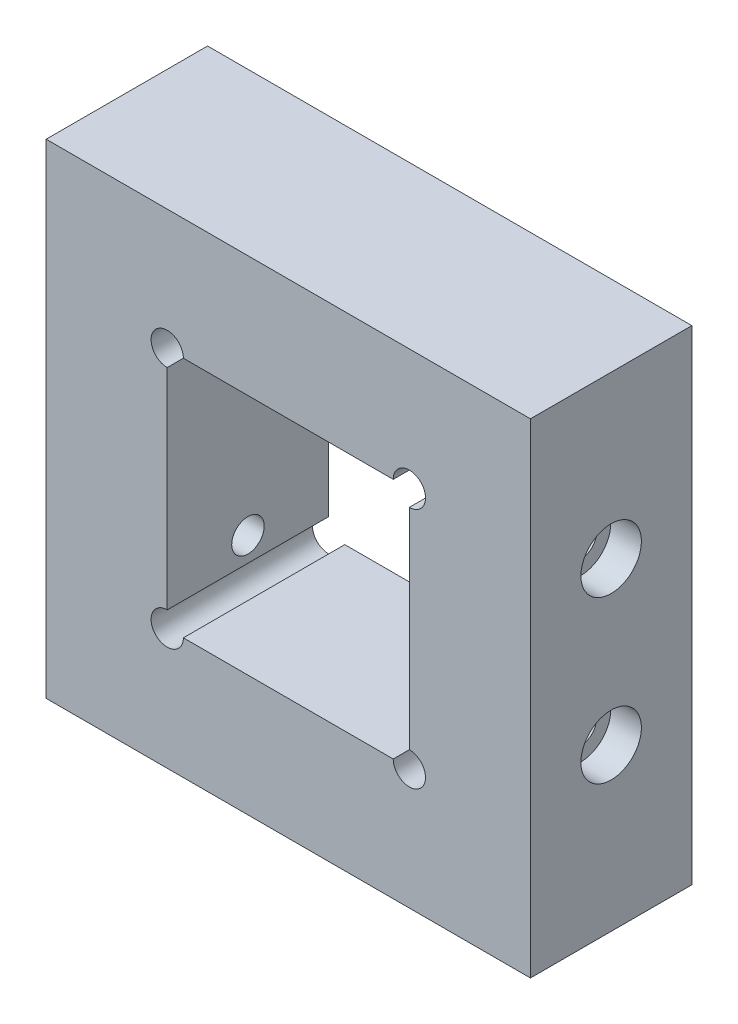
ISO-10303-21;
HEADER;
FILE_DESCRIPTION(('STEP AP214'),'2;1');
FILE_NAME('part.step','',(''),(''),'','','');
FILE_SCHEMA(('AUTOMOTIVE_DESIGN { 1 0 10303 214 1 1 1 1 }'));
ENDSEC;
DATA;
#1=APPLICATION_CONTEXT('core data for automotive mechanical design processes');
#2=APPLICATION_PROTOCOL_DEFINITION('international standard','automotive_design',2000,#1);
#3=PRODUCT_CONTEXT('',#1,'mechanical');
#4=PRODUCT('Part','Part','',(#3));
#5=PRODUCT_RELATED_PRODUCT_CATEGORY('part','',(#4));
#6=PRODUCT_DEFINITION_FORMATION('','',#4);
#7=PRODUCT_DEFINITION_CONTEXT('part definition',#1,'design');
#8=PRODUCT_DEFINITION('design','',#6,#7);
#9=PRODUCT_DEFINITION_SHAPE('','',#8);
#10=(LENGTH_UNIT() NAMED_UNIT(*) SI_UNIT(.MILLI.,.METRE.));
#11=(NAMED_UNIT(*) PLANE_ANGLE_UNIT() SI_UNIT($,.RADIAN.));
#12=(NAMED_UNIT(*) SI_UNIT($,.STERADIAN.) SOLID_ANGLE_UNIT());
#13=UNCERTAINTY_MEASURE_WITH_UNIT(LENGTH_MEASURE(1.E-05),#10,'distance_accuracy_value','');
#14=(GEOMETRIC_REPRESENTATION_CONTEXT(3) GLOBAL_UNCERTAINTY_ASSIGNED_CONTEXT((#13)) GLOBAL_UNIT_ASSIGNED_CONTEXT((#10,
#11,#12)) REPRESENTATION_CONTEXT('',''));
#15=CARTESIAN_POINT('',(0.,0.,0.));
#16=DIRECTION('',(0.,0.,1.));
#17=DIRECTION('',(1.,0.,0.));
#18=AXIS2_PLACEMENT_3D('',#15,#16,#17);
#19=CARTESIAN_POINT('',(0.,0.,12.7));
#20=DIRECTION('',(0.,0.,1.));
#21=DIRECTION('',(1.,0.,0.));
#22=AXIS2_PLACEMENT_3D('',#19,#20,#21);
#23=PLANE('',#22);
#24=DIRECTION('',(0.,-1.,0.));
#25=VECTOR('',#24,1.);
#26=CARTESIAN_POINT('',(-38.1,38.1,12.7));
#27=LINE('',#26,#25);
#28=CARTESIAN_POINT('',(-38.1,38.1,12.7));
#29=VERTEX_POINT('',#28);
#30=CARTESIAN_POINT('',(-38.1,-38.1,12.7));
#31=VERTEX_POINT('',#30);
#32=EDGE_CURVE('E159',#29,#31,#27,.T.);
#33=ORIENTED_EDGE('',*,*,#32,.T.);
#34=DIRECTION('',(1.,0.,0.));
#35=VECTOR('',#34,1.);
#36=CARTESIAN_POINT('',(-38.1,-38.1,12.7));
#37=LINE('',#36,#35);
#38=CARTESIAN_POINT('',(38.1,-38.1,12.7));
#39=VERTEX_POINT('',#38);
#40=EDGE_CURVE('E162',#31,#39,#37,.T.);
#41=ORIENTED_EDGE('',*,*,#40,.T.);
#42=DIRECTION('',(0.,1.,0.));
#43=VECTOR('',#42,1.);
#44=CARTESIAN_POINT('',(38.1,38.1,12.7));
#45=LINE('',#44,#43);
#46=CARTESIAN_POINT('',(38.1,38.1,12.7));
#47=VERTEX_POINT('',#46);
#48=EDGE_CURVE('E165',#39,#47,#45,.T.);
#49=ORIENTED_EDGE('',*,*,#48,.T.);
#50=DIRECTION('',(-1.,0.,0.));
#51=VECTOR('',#50,1.);
#52=CARTESIAN_POINT('',(-38.1,38.1,12.7));
#53=LINE('',#52,#51);
#54=EDGE_CURVE('E167',#47,#29,#53,.T.);
#55=ORIENTED_EDGE('',*,*,#54,.T.);
#56=EDGE_LOOP('',(#33,#41,#49,#55));
#57=FACE_BOUND('',#56,.T.);
#58=DIRECTION('',(1.,0.,0.));
#59=VECTOR('',#58,1.);
#60=CARTESIAN_POINT('',(-19.05,-19.05,12.7));
#61=LINE('',#60,#59);
#62=CARTESIAN_POINT('',(-16.51,-19.05,12.7));
#63=VERTEX_POINT('',#62);
#64=CARTESIAN_POINT('',(16.51,-19.05,12.7));
#65=VERTEX_POINT('',#64);
#66=EDGE_CURVE('E138',#63,#65,#61,.T.);
#67=ORIENTED_EDGE('',*,*,#66,.F.);
#68=CARTESIAN_POINT('',(-19.05,-19.05,12.7));
#69=DIRECTION('',(0.,0.,-1.));
#70=DIRECTION('',(-1.,0.,0.));
#71=AXIS2_PLACEMENT_3D('',#68,#69,#70);
#72=CIRCLE('',#71,2.54);
#73=CARTESIAN_POINT('',(-19.05,-16.51,12.7));
#74=VERTEX_POINT('',#73);
#75=EDGE_CURVE('E50',#63,#74,#72,.T.);
#76=ORIENTED_EDGE('',*,*,#75,.T.);
#77=DIRECTION('',(0.,-1.,0.));
#78=VECTOR('',#77,1.);
#79=CARTESIAN_POINT('',(-19.05,19.05,12.7));
#80=LINE('',#79,#78);
#81=CARTESIAN_POINT('',(-19.05,16.51,12.7));
#82=VERTEX_POINT('',#81);
#83=EDGE_CURVE('E136',#82,#74,#80,.T.);
#84=ORIENTED_EDGE('',*,*,#83,.F.);
#85=CARTESIAN_POINT('',(-19.05,19.05,12.7));
#86=DIRECTION('',(0.,0.,-1.));
#87=DIRECTION('',(-1.,0.,0.));
#88=AXIS2_PLACEMENT_3D('',#85,#86,#87);
#89=CIRCLE('',#88,2.54);
#90=CARTESIAN_POINT('',(-16.51,19.05,12.7));
#91=VERTEX_POINT('',#90);
#92=EDGE_CURVE('E258',#82,#91,#89,.T.);
#93=ORIENTED_EDGE('',*,*,#92,.T.);
#94=DIRECTION('',(-1.,0.,0.));
#95=VECTOR('',#94,1.);
#96=CARTESIAN_POINT('',(-19.05,19.05,12.7));
#97=LINE('',#96,#95);
#98=CARTESIAN_POINT('',(16.51,19.05,12.7));
#99=VERTEX_POINT('',#98);
#100=EDGE_CURVE('E155',#99,#91,#97,.T.);
#101=ORIENTED_EDGE('',*,*,#100,.F.);
#102=CARTESIAN_POINT('',(19.05,19.05,12.7));
#103=DIRECTION('',(0.,0.,1.));
#104=DIRECTION('',(1.,0.,0.));
#105=AXIS2_PLACEMENT_3D('',#102,#103,#104);
#106=CIRCLE('',#105,2.54);
#107=CARTESIAN_POINT('',(19.05,16.51,12.7));
#108=VERTEX_POINT('',#107);
#109=EDGE_CURVE('E299',#108,#99,#106,.T.);
#110=ORIENTED_EDGE('',*,*,#109,.F.);
#111=DIRECTION('',(0.,1.,0.));
#112=VECTOR('',#111,1.);
#113=CARTESIAN_POINT('',(19.05,19.05,12.7));
#114=LINE('',#113,#112);
#115=CARTESIAN_POINT('',(19.05,-16.51,12.7));
#116=VERTEX_POINT('',#115);
#117=EDGE_CURVE('E145',#116,#108,#114,.T.);
#118=ORIENTED_EDGE('',*,*,#117,.F.);
#119=CARTESIAN_POINT('',(19.05,-19.05,12.7));
#120=DIRECTION('',(0.,0.,1.));
#121=DIRECTION('',(1.,0.,0.));
#122=AXIS2_PLACEMENT_3D('',#119,#120,#121);
#123=CIRCLE('',#122,2.54);
#124=EDGE_CURVE('E289',#65,#116,#123,.T.);
#125=ORIENTED_EDGE('',*,*,#124,.F.);
#126=EDGE_LOOP('',(#67,#76,#84,#93,#101,#110,#118,#125));
#127=FACE_BOUND('',#126,.T.);
#128=ADVANCED_FACE('F35',(#57,#127),#23,.T.);
#129=CARTESIAN_POINT('',(0.,0.,-12.7));
#130=DIRECTION('',(0.,0.,1.));
#131=DIRECTION('',(1.,0.,0.));
#132=AXIS2_PLACEMENT_3D('',#129,#130,#131);
#133=PLANE('',#132);
#134=DIRECTION('',(0.,-1.,0.));
#135=VECTOR('',#134,1.);
#136=CARTESIAN_POINT('',(-38.1,38.1,-12.7));
#137=LINE('',#136,#135);
#138=CARTESIAN_POINT('',(-38.1,38.1,-12.7));
#139=VERTEX_POINT('',#138);
#140=CARTESIAN_POINT('',(-38.1,-38.1,-12.7));
#141=VERTEX_POINT('',#140);
#142=EDGE_CURVE('E170',#139,#141,#137,.T.);
#143=ORIENTED_EDGE('',*,*,#142,.F.);
#144=DIRECTION('',(-1.,0.,0.));
#145=VECTOR('',#144,1.);
#146=CARTESIAN_POINT('',(-38.1,38.1,-12.7));
#147=LINE('',#146,#145);
#148=CARTESIAN_POINT('',(38.1,38.1,-12.7));
#149=VERTEX_POINT('',#148);
#150=EDGE_CURVE('E163',#149,#139,#147,.T.);
#151=ORIENTED_EDGE('',*,*,#150,.F.);
#152=DIRECTION('',(0.,1.,0.));
#153=VECTOR('',#152,1.);
#154=CARTESIAN_POINT('',(38.1,38.1,-12.7));
#155=LINE('',#154,#153);
#156=CARTESIAN_POINT('',(38.1,-38.1,-12.7));
#157=VERTEX_POINT('',#156);
#158=EDGE_CURVE('E175',#157,#149,#155,.T.);
#159=ORIENTED_EDGE('',*,*,#158,.F.);
#160=DIRECTION('',(1.,0.,0.));
#161=VECTOR('',#160,1.);
#162=CARTESIAN_POINT('',(-38.1,-38.1,-12.7));
#163=LINE('',#162,#161);
#164=EDGE_CURVE('E173',#141,#157,#163,.T.);
#165=ORIENTED_EDGE('',*,*,#164,.F.);
#166=EDGE_LOOP('',(#143,#151,#159,#165));
#167=FACE_BOUND('',#166,.T.);
#168=CARTESIAN_POINT('',(-19.05,-19.05,-12.7));
#169=DIRECTION('',(0.,0.,1.));
#170=DIRECTION('',(1.,0.,0.));
#171=AXIS2_PLACEMENT_3D('',#168,#169,#170);
#172=CIRCLE('',#171,2.54);
#173=CARTESIAN_POINT('',(-19.05,-16.51,-12.7));
#174=VERTEX_POINT('',#173);
#175=CARTESIAN_POINT('',(-16.51,-19.05,-12.7));
#176=VERTEX_POINT('',#175);
#177=EDGE_CURVE('E125',#174,#176,#172,.T.);
#178=ORIENTED_EDGE('',*,*,#177,.T.);
#179=DIRECTION('',(1.,0.,0.));
#180=VECTOR('',#179,1.);
#181=CARTESIAN_POINT('',(-19.05,-19.05,-12.7));
#182=LINE('',#181,#180);
#183=CARTESIAN_POINT('',(16.51,-19.05,-12.7));
#184=VERTEX_POINT('',#183);
#185=EDGE_CURVE('E251',#176,#184,#182,.T.);
#186=ORIENTED_EDGE('',*,*,#185,.T.);
#187=CARTESIAN_POINT('',(19.05,-19.05,-12.7));
#188=DIRECTION('',(0.,0.,1.));
#189=DIRECTION('',(1.,0.,0.));
#190=AXIS2_PLACEMENT_3D('',#187,#188,#189);
#191=CIRCLE('',#190,2.54);
#192=CARTESIAN_POINT('',(19.05,-16.51,-12.7));
#193=VERTEX_POINT('',#192);
#194=EDGE_CURVE('E291',#193,#184,#191,.F.);
#195=ORIENTED_EDGE('',*,*,#194,.F.);
#196=DIRECTION('',(0.,1.,0.));
#197=VECTOR('',#196,1.);
#198=CARTESIAN_POINT('',(19.05,19.05,-12.7));
#199=LINE('',#198,#197);
#200=CARTESIAN_POINT('',(19.05,16.51,-12.7));
#201=VERTEX_POINT('',#200);
#202=EDGE_CURVE('E324',#193,#201,#199,.T.);
#203=ORIENTED_EDGE('',*,*,#202,.T.);
#204=CARTESIAN_POINT('',(19.05,19.05,-12.7));
#205=DIRECTION('',(0.,0.,1.));
#206=DIRECTION('',(1.,0.,0.));
#207=AXIS2_PLACEMENT_3D('',#204,#205,#206);
#208=CIRCLE('',#207,2.54);
#209=CARTESIAN_POINT('',(16.51,19.05,-12.7));
#210=VERTEX_POINT('',#209);
#211=EDGE_CURVE('E301',#210,#201,#208,.F.);
#212=ORIENTED_EDGE('',*,*,#211,.F.);
#213=DIRECTION('',(-1.,0.,0.));
#214=VECTOR('',#213,1.);
#215=CARTESIAN_POINT('',(-19.05,19.05,-12.7));
#216=LINE('',#215,#214);
#217=CARTESIAN_POINT('',(-16.51,19.05,-12.7));
#218=VERTEX_POINT('',#217);
#219=EDGE_CURVE('E151',#210,#218,#216,.T.);
#220=ORIENTED_EDGE('',*,*,#219,.T.);
#221=CARTESIAN_POINT('',(-19.05,19.05,-12.7));
#222=DIRECTION('',(0.,0.,1.));
#223=DIRECTION('',(1.,0.,0.));
#224=AXIS2_PLACEMENT_3D('',#221,#222,#223);
#225=CIRCLE('',#224,2.54);
#226=CARTESIAN_POINT('',(-19.05,16.51,-12.7));
#227=VERTEX_POINT('',#226);
#228=EDGE_CURVE('E58',#218,#227,#225,.T.);
#229=ORIENTED_EDGE('',*,*,#228,.T.);
#230=DIRECTION('',(0.,-1.,0.));
#231=VECTOR('',#230,1.);
#232=CARTESIAN_POINT('',(-19.05,19.05,-12.7));
#233=LINE('',#232,#231);
#234=EDGE_CURVE('E158',#227,#174,#233,.T.);
#235=ORIENTED_EDGE('',*,*,#234,.T.);
#236=EDGE_LOOP('',(#178,#186,#195,#203,#212,#220,#229,#235));
#237=FACE_BOUND('',#236,.T.);
#238=ADVANCED_FACE('F193',(#167,#237),#133,.F.);
#239=CARTESIAN_POINT('',(-19.05,19.05,-12.7));
#240=DIRECTION('',(-1.,0.,0.));
#241=DIRECTION('',(0.,-1.,0.));
#242=AXIS2_PLACEMENT_3D('',#239,#240,#241);
#243=PLANE('',#242);
#244=CARTESIAN_POINT('',(-19.05,12.7,0.));
#245=DIRECTION('',(-1.,0.,0.));
#246=DIRECTION('',(0.,-1.,0.));
#247=AXIS2_PLACEMENT_3D('',#244,#245,#246);
#248=CIRCLE('',#247,2.5527);
#249=CARTESIAN_POINT('',(-19.05,10.1473,0.));
#250=VERTEX_POINT('',#249);
#251=EDGE_CURVE('E270',#250,#250,#248,.T.);
#252=ORIENTED_EDGE('',*,*,#251,.T.);
#253=EDGE_LOOP('',(#252));
#254=FACE_BOUND('',#253,.T.);
#255=CARTESIAN_POINT('',(-19.05,-12.7,0.));
#256=DIRECTION('',(-1.,0.,0.));
#257=DIRECTION('',(0.,-1.,0.));
#258=AXIS2_PLACEMENT_3D('',#255,#256,#257);
#259=CIRCLE('',#258,2.5527);
#260=CARTESIAN_POINT('',(-19.05,-15.2527,0.));
#261=VERTEX_POINT('',#260);
#262=EDGE_CURVE('E282',#261,#261,#259,.T.);
#263=ORIENTED_EDGE('',*,*,#262,.T.);
#264=EDGE_LOOP('',(#263));
#265=FACE_BOUND('',#264,.T.);
#266=DIRECTION('',(0.,0.,1.));
#267=VECTOR('',#266,1.);
#268=CARTESIAN_POINT('',(-19.05,-16.51,-12.701));
#269=LINE('',#268,#267);
#270=EDGE_CURVE('E122',#74,#174,#269,.F.);
#271=ORIENTED_EDGE('',*,*,#270,.T.);
#272=ORIENTED_EDGE('',*,*,#234,.F.);
#273=DIRECTION('',(0.,0.,1.));
#274=VECTOR('',#273,1.);
#275=CARTESIAN_POINT('',(-19.05,16.51,-12.701));
#276=LINE('',#275,#274);
#277=EDGE_CURVE('E142',#227,#82,#276,.T.);
#278=ORIENTED_EDGE('',*,*,#277,.T.);
#279=ORIENTED_EDGE('',*,*,#83,.T.);
#280=EDGE_LOOP('',(#271,#272,#278,#279));
#281=FACE_BOUND('',#280,.T.);
#282=ADVANCED_FACE('F141',(#254,#265,#281),#243,.F.);
#283=CARTESIAN_POINT('',(-19.05,-19.05,-12.7));
#284=DIRECTION('',(0.,-1.,0.));
#285=DIRECTION('',(0.,0.,-1.));
#286=AXIS2_PLACEMENT_3D('',#283,#284,#285);
#287=PLANE('',#286);
#288=DIRECTION('',(0.,0.,1.));
#289=VECTOR('',#288,1.);
#290=CARTESIAN_POINT('',(-16.51,-19.05,-12.701));
#291=LINE('',#290,#289);
#292=EDGE_CURVE('E130',#176,#63,#291,.T.);
#293=ORIENTED_EDGE('',*,*,#292,.T.);
#294=ORIENTED_EDGE('',*,*,#66,.T.);
#295=DIRECTION('',(0.,0.,1.));
#296=VECTOR('',#295,1.);
#297=CARTESIAN_POINT('',(16.51,-19.05,-12.701));
#298=LINE('',#297,#296);
#299=EDGE_CURVE('E285',#184,#65,#298,.T.);
#300=ORIENTED_EDGE('',*,*,#299,.F.);
#301=ORIENTED_EDGE('',*,*,#185,.F.);
#302=EDGE_LOOP('',(#293,#294,#300,#301));
#303=FACE_BOUND('',#302,.T.);
#304=ADVANCED_FACE('F239',(#303),#287,.F.);
#305=CARTESIAN_POINT('',(-19.05,19.05,-12.7));
#306=DIRECTION('',(0.,1.,0.));
#307=DIRECTION('',(0.,0.,1.));
#308=AXIS2_PLACEMENT_3D('',#305,#306,#307);
#309=PLANE('',#308);
#310=DIRECTION('',(0.,0.,1.));
#311=VECTOR('',#310,1.);
#312=CARTESIAN_POINT('',(-16.51,19.05,-12.701));
#313=LINE('',#312,#311);
#314=EDGE_CURVE('E255',#91,#218,#313,.F.);
#315=ORIENTED_EDGE('',*,*,#314,.T.);
#316=ORIENTED_EDGE('',*,*,#219,.F.);
#317=DIRECTION('',(0.,0.,1.));
#318=VECTOR('',#317,1.);
#319=CARTESIAN_POINT('',(16.51,19.05,-12.701));
#320=LINE('',#319,#318);
#321=EDGE_CURVE('E297',#99,#210,#320,.F.);
#322=ORIENTED_EDGE('',*,*,#321,.F.);
#323=ORIENTED_EDGE('',*,*,#100,.T.);
#324=EDGE_LOOP('',(#315,#316,#322,#323));
#325=FACE_BOUND('',#324,.T.);
#326=ADVANCED_FACE('F211',(#325),#309,.F.);
#327=CARTESIAN_POINT('',(-38.1,38.1,12.7));
#328=DIRECTION('',(1.,0.,0.));
#329=DIRECTION('',(0.,1.,0.));
#330=AXIS2_PLACEMENT_3D('',#327,#328,#329);
#331=PLANE('',#330);
#332=CARTESIAN_POINT('',(-38.1,12.7,0.));
#333=DIRECTION('',(-1.,0.,0.));
#334=DIRECTION('',(0.,0.,1.));
#335=AXIS2_PLACEMENT_3D('',#332,#333,#334);
#336=CIRCLE('',#335,4.7625);
#337=CARTESIAN_POINT('',(-38.1,12.7,4.7625));
#338=VERTEX_POINT('',#337);
#339=EDGE_CURVE('E261',#338,#338,#336,.T.);
#340=ORIENTED_EDGE('',*,*,#339,.F.);
#341=EDGE_LOOP('',(#340));
#342=FACE_BOUND('',#341,.T.);
#343=CARTESIAN_POINT('',(-38.1,-12.7,0.));
#344=DIRECTION('',(-1.,0.,0.));
#345=DIRECTION('',(0.,0.,1.));
#346=AXIS2_PLACEMENT_3D('',#343,#344,#345);
#347=CIRCLE('',#346,4.7625);
#348=CARTESIAN_POINT('',(-38.1,-12.7,4.7625));
#349=VERTEX_POINT('',#348);
#350=EDGE_CURVE('E273',#349,#349,#347,.T.);
#351=ORIENTED_EDGE('',*,*,#350,.F.);
#352=EDGE_LOOP('',(#351));
#353=FACE_BOUND('',#352,.T.);
#354=ORIENTED_EDGE('',*,*,#142,.T.);
#355=DIRECTION('',(0.,0.,-1.));
#356=VECTOR('',#355,1.);
#357=CARTESIAN_POINT('',(-38.1,-38.1,12.7));
#358=LINE('',#357,#356);
#359=EDGE_CURVE('E11',#31,#141,#358,.T.);
#360=ORIENTED_EDGE('',*,*,#359,.F.);
#361=ORIENTED_EDGE('',*,*,#32,.F.);
#362=DIRECTION('',(0.,0.,-1.));
#363=VECTOR('',#362,1.);
#364=CARTESIAN_POINT('',(-38.1,38.1,12.7));
#365=LINE('',#364,#363);
#366=EDGE_CURVE('E169',#29,#139,#365,.T.);
#367=ORIENTED_EDGE('',*,*,#366,.T.);
#368=EDGE_LOOP('',(#354,#360,#361,#367));
#369=FACE_BOUND('',#368,.T.);
#370=ADVANCED_FACE('F37',(#342,#353,#369),#331,.F.);
#371=CARTESIAN_POINT('',(-38.1,-38.1,12.7));
#372=DIRECTION('',(0.,1.,0.));
#373=DIRECTION('',(0.,0.,1.));
#374=AXIS2_PLACEMENT_3D('',#371,#372,#373);
#375=PLANE('',#374);
#376=ORIENTED_EDGE('',*,*,#164,.T.);
#377=DIRECTION('',(0.,0.,-1.));
#378=VECTOR('',#377,1.);
#379=CARTESIAN_POINT('',(38.1,-38.1,12.7));
#380=LINE('',#379,#378);
#381=EDGE_CURVE('E43',#39,#157,#380,.T.);
#382=ORIENTED_EDGE('',*,*,#381,.F.);
#383=ORIENTED_EDGE('',*,*,#40,.F.);
#384=ORIENTED_EDGE('',*,*,#359,.T.);
#385=EDGE_LOOP('',(#376,#382,#383,#384));
#386=FACE_BOUND('',#385,.T.);
#387=ADVANCED_FACE('F203',(#386),#375,.F.);
#388=CARTESIAN_POINT('',(38.1,38.1,12.7));
#389=DIRECTION('',(-1.,0.,0.));
#390=DIRECTION('',(0.,-1.,0.));
#391=AXIS2_PLACEMENT_3D('',#388,#389,#390);
#392=PLANE('',#391);
#393=CARTESIAN_POINT('',(38.1,12.7,0.));
#394=DIRECTION('',(1.,0.,0.));
#395=DIRECTION('',(0.,0.,-1.));
#396=AXIS2_PLACEMENT_3D('',#393,#394,#395);
#397=CIRCLE('',#396,4.7625);
#398=CARTESIAN_POINT('',(38.1,12.7,-4.7625));
#399=VERTEX_POINT('',#398);
#400=EDGE_CURVE('E304',#399,#399,#397,.T.);
#401=ORIENTED_EDGE('',*,*,#400,.F.);
#402=EDGE_LOOP('',(#401));
#403=FACE_BOUND('',#402,.T.);
#404=CARTESIAN_POINT('',(38.1,-12.7,0.));
#405=DIRECTION('',(1.,0.,0.));
#406=DIRECTION('',(0.,0.,-1.));
#407=AXIS2_PLACEMENT_3D('',#404,#405,#406);
#408=CIRCLE('',#407,4.7625);
#409=CARTESIAN_POINT('',(38.1,-12.7,-4.7625));
#410=VERTEX_POINT('',#409);
#411=EDGE_CURVE('E315',#410,#410,#408,.T.);
#412=ORIENTED_EDGE('',*,*,#411,.F.);
#413=EDGE_LOOP('',(#412));
#414=FACE_BOUND('',#413,.T.);
#415=ORIENTED_EDGE('',*,*,#158,.T.);
#416=DIRECTION('',(0.,0.,-1.));
#417=VECTOR('',#416,1.);
#418=CARTESIAN_POINT('',(38.1,38.1,12.7));
#419=LINE('',#418,#417);
#420=EDGE_CURVE('E180',#47,#149,#419,.T.);
#421=ORIENTED_EDGE('',*,*,#420,.F.);
#422=ORIENTED_EDGE('',*,*,#48,.F.);
#423=ORIENTED_EDGE('',*,*,#381,.T.);
#424=EDGE_LOOP('',(#415,#421,#422,#423));
#425=FACE_BOUND('',#424,.T.);
#426=ADVANCED_FACE('F187',(#403,#414,#425),#392,.F.);
#427=CARTESIAN_POINT('',(-38.1,38.1,12.7));
#428=DIRECTION('',(0.,-1.,0.));
#429=DIRECTION('',(0.,0.,-1.));
#430=AXIS2_PLACEMENT_3D('',#427,#428,#429);
#431=PLANE('',#430);
#432=ORIENTED_EDGE('',*,*,#150,.T.);
#433=ORIENTED_EDGE('',*,*,#366,.F.);
#434=ORIENTED_EDGE('',*,*,#54,.F.);
#435=ORIENTED_EDGE('',*,*,#420,.T.);
#436=EDGE_LOOP('',(#432,#433,#434,#435));
#437=FACE_BOUND('',#436,.T.);
#438=ADVANCED_FACE('F197',(#437),#431,.F.);
#439=CARTESIAN_POINT('',(19.05,19.05,-12.7));
#440=DIRECTION('',(1.,0.,0.));
#441=DIRECTION('',(0.,1.,0.));
#442=AXIS2_PLACEMENT_3D('',#439,#440,#441);
#443=PLANE('',#442);
#444=CARTESIAN_POINT('',(19.05,12.7,0.));
#445=DIRECTION('',(1.,0.,0.));
#446=DIRECTION('',(0.,1.,0.));
#447=AXIS2_PLACEMENT_3D('',#444,#445,#446);
#448=CIRCLE('',#447,2.5527);
#449=CARTESIAN_POINT('',(19.05,15.2527,0.));
#450=VERTEX_POINT('',#449);
#451=EDGE_CURVE('E313',#450,#450,#448,.T.);
#452=ORIENTED_EDGE('',*,*,#451,.T.);
#453=EDGE_LOOP('',(#452));
#454=FACE_BOUND('',#453,.T.);
#455=CARTESIAN_POINT('',(19.05,-12.7,0.));
#456=DIRECTION('',(1.,0.,0.));
#457=DIRECTION('',(0.,1.,0.));
#458=AXIS2_PLACEMENT_3D('',#455,#456,#457);
#459=CIRCLE('',#458,2.5527);
#460=CARTESIAN_POINT('',(19.05,-10.1473,0.));
#461=VERTEX_POINT('',#460);
#462=EDGE_CURVE('E143',#461,#461,#459,.T.);
#463=ORIENTED_EDGE('',*,*,#462,.T.);
#464=EDGE_LOOP('',(#463));
#465=FACE_BOUND('',#464,.T.);
#466=ORIENTED_EDGE('',*,*,#202,.F.);
#467=DIRECTION('',(0.,0.,1.));
#468=VECTOR('',#467,1.);
#469=CARTESIAN_POINT('',(19.05,-16.51,-12.701));
#470=LINE('',#469,#468);
#471=EDGE_CURVE('E287',#116,#193,#470,.F.);
#472=ORIENTED_EDGE('',*,*,#471,.F.);
#473=ORIENTED_EDGE('',*,*,#117,.T.);
#474=DIRECTION('',(0.,0.,1.));
#475=VECTOR('',#474,1.);
#476=CARTESIAN_POINT('',(19.05,16.51,-12.701));
#477=LINE('',#476,#475);
#478=EDGE_CURVE('E294',#201,#108,#477,.T.);
#479=ORIENTED_EDGE('',*,*,#478,.F.);
#480=EDGE_LOOP('',(#466,#472,#473,#479));
#481=FACE_BOUND('',#480,.T.);
#482=ADVANCED_FACE('F223',(#454,#465,#481),#443,.F.);
#483=CARTESIAN_POINT('',(38.1,-12.7,0.));
#484=DIRECTION('',(1.,0.,0.));
#485=DIRECTION('',(0.,0.,-1.));
#486=AXIS2_PLACEMENT_3D('',#483,#484,#485);
#487=CYLINDRICAL_SURFACE('',#486,2.5527);
#488=ORIENTED_EDGE('',*,*,#462,.F.);
#489=EDGE_LOOP('',(#488));
#490=FACE_BOUND('',#489,.T.);
#491=CARTESIAN_POINT('',(33.274,-12.7,0.));
#492=DIRECTION('',(1.,0.,0.));
#493=DIRECTION('',(0.,0.,-1.));
#494=AXIS2_PLACEMENT_3D('',#491,#492,#493);
#495=CIRCLE('',#494,2.55270000000001);
#496=CARTESIAN_POINT('',(33.274,-12.7,-2.55270000000001));
#497=VERTEX_POINT('',#496);
#498=EDGE_CURVE('E148',#497,#497,#495,.T.);
#499=ORIENTED_EDGE('',*,*,#498,.T.);
#500=EDGE_LOOP('',(#499));
#501=FACE_BOUND('',#500,.T.);
#502=ADVANCED_FACE('F227',(#490,#501),#487,.F.);
#503=CARTESIAN_POINT('',(33.274,-10.1473,0.));
#504=DIRECTION('',(-1.,0.,0.));
#505=DIRECTION('',(0.,0.,1.));
#506=AXIS2_PLACEMENT_3D('',#503,#504,#505);
#507=PLANE('',#506);
#508=ORIENTED_EDGE('',*,*,#498,.F.);
#509=EDGE_LOOP('',(#508));
#510=FACE_BOUND('',#509,.T.);
#511=CARTESIAN_POINT('',(33.274,-12.7,0.));
#512=DIRECTION('',(1.,0.,0.));
#513=DIRECTION('',(0.,0.,-1.));
#514=AXIS2_PLACEMENT_3D('',#511,#512,#513);
#515=CIRCLE('',#514,4.7625);
#516=CARTESIAN_POINT('',(33.274,-12.7,-4.7625));
#517=VERTEX_POINT('',#516);
#518=EDGE_CURVE('E318',#517,#517,#515,.T.);
#519=ORIENTED_EDGE('',*,*,#518,.T.);
#520=EDGE_LOOP('',(#519));
#521=FACE_BOUND('',#520,.T.);
#522=ADVANCED_FACE('F233',(#510,#521),#507,.F.);
#523=CARTESIAN_POINT('',(38.1,-12.7,0.));
#524=DIRECTION('',(1.,0.,0.));
#525=DIRECTION('',(0.,0.,-1.));
#526=AXIS2_PLACEMENT_3D('',#523,#524,#525);
#527=CYLINDRICAL_SURFACE('',#526,4.7625);
#528=ORIENTED_EDGE('',*,*,#518,.F.);
#529=EDGE_LOOP('',(#528));
#530=FACE_BOUND('',#529,.T.);
#531=ORIENTED_EDGE('',*,*,#411,.T.);
#532=EDGE_LOOP('',(#531));
#533=FACE_BOUND('',#532,.T.);
#534=ADVANCED_FACE('F366',(#530,#533),#527,.F.);
#535=CARTESIAN_POINT('',(38.1,12.7,0.));
#536=DIRECTION('',(1.,0.,0.));
#537=DIRECTION('',(0.,0.,-1.));
#538=AXIS2_PLACEMENT_3D('',#535,#536,#537);
#539=CYLINDRICAL_SURFACE('',#538,2.5527);
#540=ORIENTED_EDGE('',*,*,#451,.F.);
#541=EDGE_LOOP('',(#540));
#542=FACE_BOUND('',#541,.T.);
#543=CARTESIAN_POINT('',(33.274,12.7,0.));
#544=DIRECTION('',(1.,0.,0.));
#545=DIRECTION('',(0.,0.,-1.));
#546=AXIS2_PLACEMENT_3D('',#543,#544,#545);
#547=CIRCLE('',#546,2.55270000000001);
#548=CARTESIAN_POINT('',(33.274,12.7,-2.55270000000001));
#549=VERTEX_POINT('',#548);
#550=EDGE_CURVE('E310',#549,#549,#547,.T.);
#551=ORIENTED_EDGE('',*,*,#550,.T.);
#552=EDGE_LOOP('',(#551));
#553=FACE_BOUND('',#552,.T.);
#554=ADVANCED_FACE('F362',(#542,#553),#539,.F.);
#555=CARTESIAN_POINT('',(33.274,15.2527,0.));
#556=DIRECTION('',(-1.,0.,0.));
#557=DIRECTION('',(0.,0.,1.));
#558=AXIS2_PLACEMENT_3D('',#555,#556,#557);
#559=PLANE('',#558);
#560=ORIENTED_EDGE('',*,*,#550,.F.);
#561=EDGE_LOOP('',(#560));
#562=FACE_BOUND('',#561,.T.);
#563=CARTESIAN_POINT('',(33.274,12.7,0.));
#564=DIRECTION('',(1.,0.,0.));
#565=DIRECTION('',(0.,0.,-1.));
#566=AXIS2_PLACEMENT_3D('',#563,#564,#565);
#567=CIRCLE('',#566,4.7625);
#568=CARTESIAN_POINT('',(33.274,12.7,-4.7625));
#569=VERTEX_POINT('',#568);
#570=EDGE_CURVE('E307',#569,#569,#567,.T.);
#571=ORIENTED_EDGE('',*,*,#570,.T.);
#572=EDGE_LOOP('',(#571));
#573=FACE_BOUND('',#572,.T.);
#574=ADVANCED_FACE('F358',(#562,#573),#559,.F.);
#575=CARTESIAN_POINT('',(38.1,12.7,0.));
#576=DIRECTION('',(1.,0.,0.));
#577=DIRECTION('',(0.,0.,-1.));
#578=AXIS2_PLACEMENT_3D('',#575,#576,#577);
#579=CYLINDRICAL_SURFACE('',#578,4.7625);
#580=ORIENTED_EDGE('',*,*,#570,.F.);
#581=EDGE_LOOP('',(#580));
#582=FACE_BOUND('',#581,.T.);
#583=ORIENTED_EDGE('',*,*,#400,.T.);
#584=EDGE_LOOP('',(#583));
#585=FACE_BOUND('',#584,.T.);
#586=ADVANCED_FACE('F352',(#582,#585),#579,.F.);
#587=CARTESIAN_POINT('',(19.05,19.05,-12.701));
#588=DIRECTION('',(0.,0.,1.));
#589=DIRECTION('',(1.,0.,0.));
#590=AXIS2_PLACEMENT_3D('',#587,#588,#589);
#591=CYLINDRICAL_SURFACE('',#590,2.54);
#592=ORIENTED_EDGE('',*,*,#321,.T.);
#593=ORIENTED_EDGE('',*,*,#211,.T.);
#594=ORIENTED_EDGE('',*,*,#478,.T.);
#595=ORIENTED_EDGE('',*,*,#109,.T.);
#596=EDGE_LOOP('',(#592,#593,#594,#595));
#597=FACE_BOUND('',#596,.T.);
#598=ADVANCED_FACE('F336',(#597),#591,.F.);
#599=CARTESIAN_POINT('',(19.05,-19.05,-12.701));
#600=DIRECTION('',(0.,0.,1.));
#601=DIRECTION('',(1.,0.,0.));
#602=AXIS2_PLACEMENT_3D('',#599,#600,#601);
#603=CYLINDRICAL_SURFACE('',#602,2.54);
#604=ORIENTED_EDGE('',*,*,#471,.T.);
#605=ORIENTED_EDGE('',*,*,#194,.T.);
#606=ORIENTED_EDGE('',*,*,#299,.T.);
#607=ORIENTED_EDGE('',*,*,#124,.T.);
#608=EDGE_LOOP('',(#604,#605,#606,#607));
#609=FACE_BOUND('',#608,.T.);
#610=ADVANCED_FACE('F341',(#609),#603,.F.);
#611=CARTESIAN_POINT('',(-38.1,-12.7,0.));
#612=DIRECTION('',(-1.,0.,0.));
#613=DIRECTION('',(0.,0.,1.));
#614=AXIS2_PLACEMENT_3D('',#611,#612,#613);
#615=CYLINDRICAL_SURFACE('',#614,2.5527);
#616=ORIENTED_EDGE('',*,*,#262,.F.);
#617=EDGE_LOOP('',(#616));
#618=FACE_BOUND('',#617,.T.);
#619=CARTESIAN_POINT('',(-33.274,-12.7,0.));
#620=DIRECTION('',(-1.,0.,0.));
#621=DIRECTION('',(0.,0.,1.));
#622=AXIS2_PLACEMENT_3D('',#619,#620,#621);
#623=CIRCLE('',#622,2.55270000000001);
#624=CARTESIAN_POINT('',(-33.274,-12.7,2.55270000000001));
#625=VERTEX_POINT('',#624);
#626=EDGE_CURVE('E279',#625,#625,#623,.T.);
#627=ORIENTED_EDGE('',*,*,#626,.T.);
#628=EDGE_LOOP('',(#627));
#629=FACE_BOUND('',#628,.T.);
#630=ADVANCED_FACE('F343',(#618,#629),#615,.F.);
#631=CARTESIAN_POINT('',(-33.274,-10.1473,0.));
#632=DIRECTION('',(1.,0.,0.));
#633=DIRECTION('',(0.,0.,-1.));
#634=AXIS2_PLACEMENT_3D('',#631,#632,#633);
#635=PLANE('',#634);
#636=ORIENTED_EDGE('',*,*,#626,.F.);
#637=EDGE_LOOP('',(#636));
#638=FACE_BOUND('',#637,.T.);
#639=CARTESIAN_POINT('',(-33.274,-12.7,0.));
#640=DIRECTION('',(-1.,0.,0.));
#641=DIRECTION('',(0.,0.,1.));
#642=AXIS2_PLACEMENT_3D('',#639,#640,#641);
#643=CIRCLE('',#642,4.7625);
#644=CARTESIAN_POINT('',(-33.274,-12.7,4.7625));
#645=VERTEX_POINT('',#644);
#646=EDGE_CURVE('E276',#645,#645,#643,.T.);
#647=ORIENTED_EDGE('',*,*,#646,.T.);
#648=EDGE_LOOP('',(#647));
#649=FACE_BOUND('',#648,.T.);
#650=ADVANCED_FACE('F349',(#638,#649),#635,.F.);
#651=CARTESIAN_POINT('',(-38.1,-12.7,0.));
#652=DIRECTION('',(-1.,0.,0.));
#653=DIRECTION('',(0.,0.,1.));
#654=AXIS2_PLACEMENT_3D('',#651,#652,#653);
#655=CYLINDRICAL_SURFACE('',#654,4.7625);
#656=ORIENTED_EDGE('',*,*,#646,.F.);
#657=EDGE_LOOP('',(#656));
#658=FACE_BOUND('',#657,.T.);
#659=ORIENTED_EDGE('',*,*,#350,.T.);
#660=EDGE_LOOP('',(#659));
#661=FACE_BOUND('',#660,.T.);
#662=ADVANCED_FACE('F460',(#658,#661),#655,.F.);
#663=CARTESIAN_POINT('',(-38.1,12.7,0.));
#664=DIRECTION('',(-1.,0.,0.));
#665=DIRECTION('',(0.,0.,1.));
#666=AXIS2_PLACEMENT_3D('',#663,#664,#665);
#667=CYLINDRICAL_SURFACE('',#666,2.5527);
#668=ORIENTED_EDGE('',*,*,#251,.F.);
#669=EDGE_LOOP('',(#668));
#670=FACE_BOUND('',#669,.T.);
#671=CARTESIAN_POINT('',(-33.274,12.7,0.));
#672=DIRECTION('',(-1.,0.,0.));
#673=DIRECTION('',(0.,0.,1.));
#674=AXIS2_PLACEMENT_3D('',#671,#672,#673);
#675=CIRCLE('',#674,2.55270000000001);
#676=CARTESIAN_POINT('',(-33.274,12.7,2.55270000000001));
#677=VERTEX_POINT('',#676);
#678=EDGE_CURVE('E267',#677,#677,#675,.T.);
#679=ORIENTED_EDGE('',*,*,#678,.T.);
#680=EDGE_LOOP('',(#679));
#681=FACE_BOUND('',#680,.T.);
#682=ADVANCED_FACE('F469',(#670,#681),#667,.F.);
#683=CARTESIAN_POINT('',(-33.274,15.2527,0.));
#684=DIRECTION('',(1.,0.,0.));
#685=DIRECTION('',(0.,0.,-1.));
#686=AXIS2_PLACEMENT_3D('',#683,#684,#685);
#687=PLANE('',#686);
#688=ORIENTED_EDGE('',*,*,#678,.F.);
#689=EDGE_LOOP('',(#688));
#690=FACE_BOUND('',#689,.T.);
#691=CARTESIAN_POINT('',(-33.274,12.7,0.));
#692=DIRECTION('',(-1.,0.,0.));
#693=DIRECTION('',(0.,0.,1.));
#694=AXIS2_PLACEMENT_3D('',#691,#692,#693);
#695=CIRCLE('',#694,4.7625);
#696=CARTESIAN_POINT('',(-33.274,12.7,4.7625));
#697=VERTEX_POINT('',#696);
#698=EDGE_CURVE('E264',#697,#697,#695,.T.);
#699=ORIENTED_EDGE('',*,*,#698,.T.);
#700=EDGE_LOOP('',(#699));
#701=FACE_BOUND('',#700,.T.);
#702=ADVANCED_FACE('F479',(#690,#701),#687,.F.);
#703=CARTESIAN_POINT('',(-38.1,12.7,0.));
#704=DIRECTION('',(-1.,0.,0.));
#705=DIRECTION('',(0.,0.,1.));
#706=AXIS2_PLACEMENT_3D('',#703,#704,#705);
#707=CYLINDRICAL_SURFACE('',#706,4.7625);
#708=ORIENTED_EDGE('',*,*,#698,.F.);
#709=EDGE_LOOP('',(#708));
#710=FACE_BOUND('',#709,.T.);
#711=ORIENTED_EDGE('',*,*,#339,.T.);
#712=EDGE_LOOP('',(#711));
#713=FACE_BOUND('',#712,.T.);
#714=ADVANCED_FACE('F489',(#710,#713),#707,.F.);
#715=CARTESIAN_POINT('',(-19.05,19.05,-12.701));
#716=DIRECTION('',(0.,0.,1.));
#717=DIRECTION('',(1.,0.,0.));
#718=AXIS2_PLACEMENT_3D('',#715,#716,#717);
#719=CYLINDRICAL_SURFACE('',#718,2.54);
#720=ORIENTED_EDGE('',*,*,#228,.F.);
#721=ORIENTED_EDGE('',*,*,#314,.F.);
#722=ORIENTED_EDGE('',*,*,#92,.F.);
#723=ORIENTED_EDGE('',*,*,#277,.F.);
#724=EDGE_LOOP('',(#720,#721,#722,#723));
#725=FACE_BOUND('',#724,.T.);
#726=ADVANCED_FACE('F332',(#725),#719,.F.);
#727=CARTESIAN_POINT('',(-19.05,-19.05,-12.701));
#728=DIRECTION('',(0.,0.,1.));
#729=DIRECTION('',(1.,0.,0.));
#730=AXIS2_PLACEMENT_3D('',#727,#728,#729);
#731=CYLINDRICAL_SURFACE('',#730,2.54);
#732=ORIENTED_EDGE('',*,*,#75,.F.);
#733=ORIENTED_EDGE('',*,*,#292,.F.);
#734=ORIENTED_EDGE('',*,*,#177,.F.);
#735=ORIENTED_EDGE('',*,*,#270,.F.);
#736=EDGE_LOOP('',(#732,#733,#734,#735));
#737=FACE_BOUND('',#736,.T.);
#738=ADVANCED_FACE('F123',(#737),#731,.F.);
#739=CLOSED_SHELL('',(#128,#238,#282,#304,#326,#370,#387,#426,#438,#482,#502,#522,#534,#554,
#574,#586,#598,#610,#630,#650,#662,#682,#702,#714,#726,#738));
#740=MANIFOLD_SOLID_BREP('B2',#739);
#741=ADVANCED_BREP_SHAPE_REPRESENTATION('',(#18,#740),#14);
#742=SHAPE_DEFINITION_REPRESENTATION(#9,#741);
ENDSEC;
END-ISO-10303-21;
